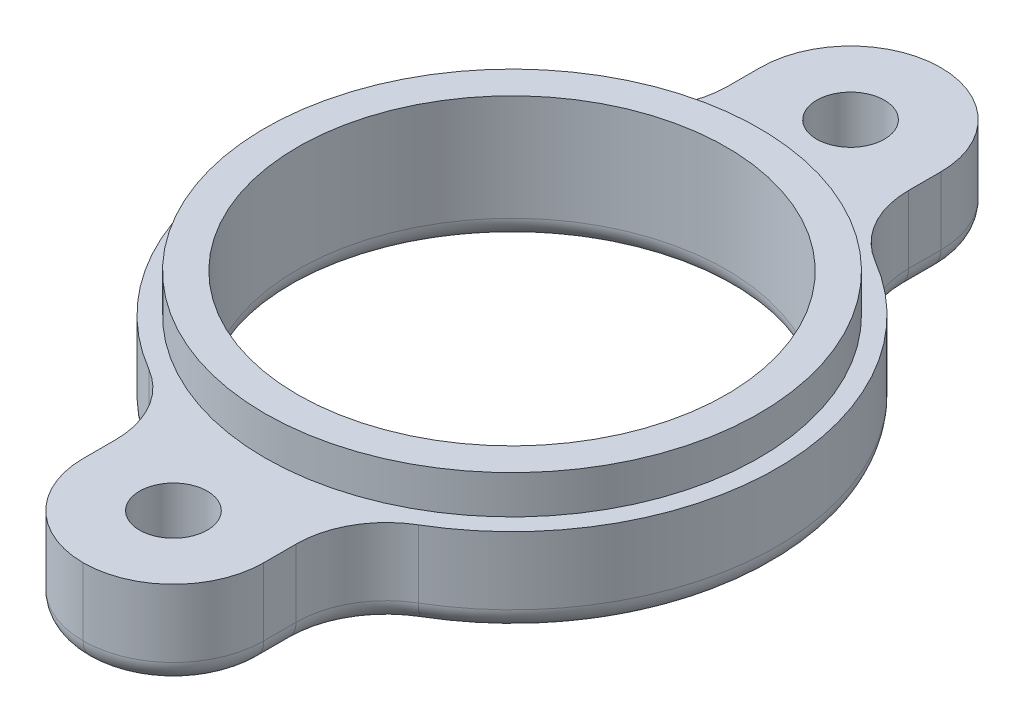
ISO-10303-21;
HEADER;
FILE_DESCRIPTION(('STEP AP214'),'2;1');
FILE_NAME('part.step','',(''),(''),'','','');
FILE_SCHEMA(('AUTOMOTIVE_DESIGN { 1 0 10303 214 1 1 1 1 }'));
ENDSEC;
DATA;
#1=APPLICATION_CONTEXT('core data for automotive mechanical design processes');
#2=APPLICATION_PROTOCOL_DEFINITION('international standard','automotive_design',2000,#1);
#3=PRODUCT_CONTEXT('',#1,'mechanical');
#4=PRODUCT('Part','Part','',(#3));
#5=PRODUCT_RELATED_PRODUCT_CATEGORY('part','',(#4));
#6=PRODUCT_DEFINITION_FORMATION('','',#4);
#7=PRODUCT_DEFINITION_CONTEXT('part definition',#1,'design');
#8=PRODUCT_DEFINITION('design','',#6,#7);
#9=PRODUCT_DEFINITION_SHAPE('','',#8);
#10=(LENGTH_UNIT() NAMED_UNIT(*) SI_UNIT(.MILLI.,.METRE.));
#11=(NAMED_UNIT(*) PLANE_ANGLE_UNIT() SI_UNIT($,.RADIAN.));
#12=(NAMED_UNIT(*) SI_UNIT($,.STERADIAN.) SOLID_ANGLE_UNIT());
#13=UNCERTAINTY_MEASURE_WITH_UNIT(LENGTH_MEASURE(1.E-05),#10,'distance_accuracy_value','');
#14=(GEOMETRIC_REPRESENTATION_CONTEXT(3) GLOBAL_UNCERTAINTY_ASSIGNED_CONTEXT((#13)) GLOBAL_UNIT_ASSIGNED_CONTEXT((#10,
#11,#12)) REPRESENTATION_CONTEXT('',''));
#15=CARTESIAN_POINT('',(0.,0.,0.));
#16=DIRECTION('',(0.,0.,1.));
#17=DIRECTION('',(1.,0.,0.));
#18=AXIS2_PLACEMENT_3D('',#15,#16,#17);
#19=CARTESIAN_POINT('',(0.,1.7,0.));
#20=DIRECTION('',(0.,1.,0.));
#21=DIRECTION('',(0.,0.,1.));
#22=AXIS2_PLACEMENT_3D('',#19,#20,#21);
#23=PLANE('',#22);
#24=CARTESIAN_POINT('',(0.,1.7,0.));
#25=DIRECTION('',(0.,1.,0.));
#26=DIRECTION('',(0.,0.,1.));
#27=AXIS2_PLACEMENT_3D('',#24,#25,#26);
#28=CIRCLE('',#27,10.95);
#29=CARTESIAN_POINT('',(0.,1.7,10.95));
#30=VERTEX_POINT('',#29);
#31=EDGE_CURVE('E207',#30,#30,#28,.T.);
#32=ORIENTED_EDGE('',*,*,#31,.T.);
#33=EDGE_LOOP('',(#32));
#34=FACE_BOUND('',#33,.T.);
#35=CARTESIAN_POINT('',(0.,1.7,0.));
#36=DIRECTION('',(0.,1.,0.));
#37=DIRECTION('',(0.,0.,1.));
#38=AXIS2_PLACEMENT_3D('',#35,#36,#37);
#39=CIRCLE('',#38,9.5);
#40=CARTESIAN_POINT('',(0.,1.7,9.5));
#41=VERTEX_POINT('',#40);
#42=EDGE_CURVE('E212',#41,#41,#39,.T.);
#43=ORIENTED_EDGE('',*,*,#42,.F.);
#44=EDGE_LOOP('',(#43));
#45=FACE_BOUND('',#44,.T.);
#46=ADVANCED_FACE('F37',(#34,#45),#23,.T.);
#47=CARTESIAN_POINT('',(0.,1.7,0.));
#48=DIRECTION('',(0.,-1.,0.));
#49=DIRECTION('',(0.,0.,-1.));
#50=AXIS2_PLACEMENT_3D('',#47,#48,#49);
#51=CYLINDRICAL_SURFACE('',#50,10.95);
#52=ORIENTED_EDGE('',*,*,#31,.F.);
#53=EDGE_LOOP('',(#52));
#54=FACE_BOUND('',#53,.T.);
#55=CARTESIAN_POINT('',(0.,0.,0.));
#56=DIRECTION('',(0.,1.,0.));
#57=DIRECTION('',(0.,0.,1.));
#58=AXIS2_PLACEMENT_3D('',#55,#56,#57);
#59=CIRCLE('',#58,10.95);
#60=CARTESIAN_POINT('',(0.,0.,10.95));
#61=VERTEX_POINT('',#60);
#62=EDGE_CURVE('E215',#61,#61,#59,.T.);
#63=ORIENTED_EDGE('',*,*,#62,.T.);
#64=EDGE_LOOP('',(#63));
#65=FACE_BOUND('',#64,.T.);
#66=ADVANCED_FACE('F438',(#54,#65),#51,.T.);
#67=CARTESIAN_POINT('',(0.,1.7,0.));
#68=DIRECTION('',(0.,-1.,0.));
#69=DIRECTION('',(0.,0.,-1.));
#70=AXIS2_PLACEMENT_3D('',#67,#68,#69);
#71=CYLINDRICAL_SURFACE('',#70,9.5);
#72=CARTESIAN_POINT('',(0.,-3.,0.));
#73=DIRECTION('',(0.,1.,0.));
#74=DIRECTION('',(0.,0.,1.));
#75=AXIS2_PLACEMENT_3D('',#72,#73,#74);
#76=CIRCLE('',#75,9.5);
#77=CARTESIAN_POINT('',(0.,-3.,9.5));
#78=VERTEX_POINT('',#77);
#79=EDGE_CURVE('E46',#78,#78,#76,.F.);
#80=ORIENTED_EDGE('',*,*,#79,.T.);
#81=EDGE_LOOP('',(#80));
#82=FACE_BOUND('',#81,.T.);
#83=ORIENTED_EDGE('',*,*,#42,.T.);
#84=EDGE_LOOP('',(#83));
#85=FACE_BOUND('',#84,.T.);
#86=ADVANCED_FACE('F444',(#82,#85),#71,.F.);
#87=CARTESIAN_POINT('',(0.,-4.,0.));
#88=DIRECTION('',(0.,1.,0.));
#89=DIRECTION('',(0.,0.,1.));
#90=AXIS2_PLACEMENT_3D('',#87,#88,#89);
#91=CYLINDRICAL_SURFACE('',#90,11.75);
#92=DIRECTION('',(0.,1.,0.));
#93=VECTOR('',#92,1.);
#94=CARTESIAN_POINT('',(5.96825396825397,-4.,10.1213855064621));
#95=LINE('',#94,#93);
#96=CARTESIAN_POINT('',(5.96825396825397,0.,10.1213855064621));
#97=VERTEX_POINT('',#96);
#98=CARTESIAN_POINT('',(5.96825396825397,-3.,10.1213855064621));
#99=VERTEX_POINT('',#98);
#100=EDGE_CURVE('E197',#97,#99,#95,.F.);
#101=ORIENTED_EDGE('',*,*,#100,.T.);
#102=CARTESIAN_POINT('',(0.,-3.,0.));
#103=DIRECTION('',(0.,1.,0.));
#104=DIRECTION('',(0.,0.,1.));
#105=AXIS2_PLACEMENT_3D('',#102,#103,#104);
#106=CIRCLE('',#105,11.75);
#107=CARTESIAN_POINT('',(5.96825396825397,-3.,-10.1213855064621));
#108=VERTEX_POINT('',#107);
#109=EDGE_CURVE('E11',#99,#108,#106,.T.);
#110=ORIENTED_EDGE('',*,*,#109,.T.);
#111=DIRECTION('',(0.,1.,0.));
#112=VECTOR('',#111,1.);
#113=CARTESIAN_POINT('',(5.96825396825397,-4.,-10.1213855064621));
#114=LINE('',#113,#112);
#115=CARTESIAN_POINT('',(5.96825396825397,0.,-10.1213855064621));
#116=VERTEX_POINT('',#115);
#117=EDGE_CURVE('E198',#108,#116,#114,.T.);
#118=ORIENTED_EDGE('',*,*,#117,.T.);
#119=CARTESIAN_POINT('',(0.,0.,0.));
#120=DIRECTION('',(0.,1.,0.));
#121=DIRECTION('',(0.,0.,1.));
#122=AXIS2_PLACEMENT_3D('',#119,#120,#121);
#123=CIRCLE('',#122,11.75);
#124=EDGE_CURVE('E187',#97,#116,#123,.T.);
#125=ORIENTED_EDGE('',*,*,#124,.F.);
#126=EDGE_LOOP('',(#101,#110,#118,#125));
#127=FACE_BOUND('',#126,.T.);
#128=ADVANCED_FACE('F196',(#127),#91,.T.);
#129=CARTESIAN_POINT('',(4.,-4.,0.));
#130=DIRECTION('',(1.,0.,0.));
#131=DIRECTION('',(0.,0.,-1.));
#132=AXIS2_PLACEMENT_3D('',#129,#130,#131);
#133=PLANE('',#132);
#134=DIRECTION('',(0.,1.,0.));
#135=VECTOR('',#134,1.);
#136=CARTESIAN_POINT('',(4.,-4.,15.));
#137=LINE('',#136,#135);
#138=CARTESIAN_POINT('',(4.,0.,15.));
#139=VERTEX_POINT('',#138);
#140=CARTESIAN_POINT('',(4.,-3.,15.));
#141=VERTEX_POINT('',#140);
#142=EDGE_CURVE('E243',#139,#141,#137,.F.);
#143=ORIENTED_EDGE('',*,*,#142,.T.);
#144=DIRECTION('',(0.,0.,-1.));
#145=VECTOR('',#144,1.);
#146=CARTESIAN_POINT('',(4.,-3.,13.5669635512151));
#147=LINE('',#146,#145);
#148=CARTESIAN_POINT('',(4.,-3.,13.5669635512151));
#149=VERTEX_POINT('',#148);
#150=EDGE_CURVE('E290',#141,#149,#147,.T.);
#151=ORIENTED_EDGE('',*,*,#150,.T.);
#152=DIRECTION('',(0.,-1.,0.));
#153=VECTOR('',#152,1.);
#154=CARTESIAN_POINT('',(4.,0.,13.5669635512151));
#155=LINE('',#154,#153);
#156=CARTESIAN_POINT('',(4.,0.,13.5669635512151));
#157=VERTEX_POINT('',#156);
#158=EDGE_CURVE('E246',#149,#157,#155,.F.);
#159=ORIENTED_EDGE('',*,*,#158,.T.);
#160=DIRECTION('',(0.,0.,-1.));
#161=VECTOR('',#160,1.);
#162=CARTESIAN_POINT('',(4.,0.,0.));
#163=LINE('',#162,#161);
#164=EDGE_CURVE('E189',#139,#157,#163,.T.);
#165=ORIENTED_EDGE('',*,*,#164,.F.);
#166=EDGE_LOOP('',(#143,#151,#159,#165));
#167=FACE_BOUND('',#166,.T.);
#168=ADVANCED_FACE('F700',(#167),#133,.T.);
#169=CARTESIAN_POINT('',(-4.,-4.,0.));
#170=DIRECTION('',(1.,0.,0.));
#171=DIRECTION('',(0.,0.,-1.));
#172=AXIS2_PLACEMENT_3D('',#169,#170,#171);
#173=PLANE('',#172);
#174=DIRECTION('',(0.,1.,0.));
#175=VECTOR('',#174,1.);
#176=CARTESIAN_POINT('',(-4.,-4.,13.5669635512151));
#177=LINE('',#176,#175);
#178=CARTESIAN_POINT('',(-4.,0.,13.5669635512151));
#179=VERTEX_POINT('',#178);
#180=CARTESIAN_POINT('',(-4.,-3.,13.5669635512151));
#181=VERTEX_POINT('',#180);
#182=EDGE_CURVE('E240',#179,#181,#177,.F.);
#183=ORIENTED_EDGE('',*,*,#182,.T.);
#184=DIRECTION('',(0.,0.,-1.));
#185=VECTOR('',#184,1.);
#186=CARTESIAN_POINT('',(-4.,-3.,0.));
#187=LINE('',#186,#185);
#188=CARTESIAN_POINT('',(-4.,-3.,15.));
#189=VERTEX_POINT('',#188);
#190=EDGE_CURVE('E296',#181,#189,#187,.F.);
#191=ORIENTED_EDGE('',*,*,#190,.T.);
#192=DIRECTION('',(0.,1.,0.));
#193=VECTOR('',#192,1.);
#194=CARTESIAN_POINT('',(-4.,0.,15.));
#195=LINE('',#194,#193);
#196=CARTESIAN_POINT('',(-4.,0.,15.));
#197=VERTEX_POINT('',#196);
#198=EDGE_CURVE('E238',#189,#197,#195,.T.);
#199=ORIENTED_EDGE('',*,*,#198,.T.);
#200=DIRECTION('',(0.,0.,-1.));
#201=VECTOR('',#200,1.);
#202=CARTESIAN_POINT('',(-4.,0.,0.));
#203=LINE('',#202,#201);
#204=EDGE_CURVE('E377',#197,#179,#203,.T.);
#205=ORIENTED_EDGE('',*,*,#204,.T.);
#206=EDGE_LOOP('',(#183,#191,#199,#205));
#207=FACE_BOUND('',#206,.T.);
#208=ADVANCED_FACE('F434',(#207),#173,.F.);
#209=CARTESIAN_POINT('',(0.,-4.,0.));
#210=DIRECTION('',(0.,1.,0.));
#211=DIRECTION('',(0.,0.,1.));
#212=AXIS2_PLACEMENT_3D('',#209,#210,#211);
#213=CYLINDRICAL_SURFACE('',#212,11.75);
#214=DIRECTION('',(0.,1.,0.));
#215=VECTOR('',#214,1.);
#216=CARTESIAN_POINT('',(-5.96825396825397,-4.,-10.1213855064621));
#217=LINE('',#216,#215);
#218=CARTESIAN_POINT('',(-5.96825396825397,0.,-10.1213855064621));
#219=VERTEX_POINT('',#218);
#220=CARTESIAN_POINT('',(-5.96825396825397,-3.,-10.1213855064621));
#221=VERTEX_POINT('',#220);
#222=EDGE_CURVE('E235',#219,#221,#217,.F.);
#223=ORIENTED_EDGE('',*,*,#222,.T.);
#224=CARTESIAN_POINT('',(0.,-3.,0.));
#225=DIRECTION('',(0.,1.,0.));
#226=DIRECTION('',(0.,0.,1.));
#227=AXIS2_PLACEMENT_3D('',#224,#225,#226);
#228=CIRCLE('',#227,11.75);
#229=CARTESIAN_POINT('',(-5.96825396825397,-3.,10.1213855064621));
#230=VERTEX_POINT('',#229);
#231=EDGE_CURVE('E300',#221,#230,#228,.T.);
#232=ORIENTED_EDGE('',*,*,#231,.T.);
#233=DIRECTION('',(0.,1.,0.));
#234=VECTOR('',#233,1.);
#235=CARTESIAN_POINT('',(-5.96825396825397,-4.,10.1213855064621));
#236=LINE('',#235,#234);
#237=CARTESIAN_POINT('',(-5.96825396825397,0.,10.1213855064621));
#238=VERTEX_POINT('',#237);
#239=EDGE_CURVE('E233',#230,#238,#236,.T.);
#240=ORIENTED_EDGE('',*,*,#239,.T.);
#241=CARTESIAN_POINT('',(0.,0.,0.));
#242=DIRECTION('',(0.,1.,0.));
#243=DIRECTION('',(0.,0.,1.));
#244=AXIS2_PLACEMENT_3D('',#241,#242,#243);
#245=CIRCLE('',#244,11.75);
#246=EDGE_CURVE('E375',#219,#238,#245,.T.);
#247=ORIENTED_EDGE('',*,*,#246,.F.);
#248=EDGE_LOOP('',(#223,#232,#240,#247));
#249=FACE_BOUND('',#248,.T.);
#250=ADVANCED_FACE('F372',(#249),#213,.T.);
#251=CARTESIAN_POINT('',(-4.,-4.,0.));
#252=DIRECTION('',(1.,0.,0.));
#253=DIRECTION('',(0.,0.,-1.));
#254=AXIS2_PLACEMENT_3D('',#251,#252,#253);
#255=PLANE('',#254);
#256=DIRECTION('',(0.,1.,0.));
#257=VECTOR('',#256,1.);
#258=CARTESIAN_POINT('',(-4.,-4.,-15.));
#259=LINE('',#258,#257);
#260=CARTESIAN_POINT('',(-4.,0.,-15.));
#261=VERTEX_POINT('',#260);
#262=CARTESIAN_POINT('',(-4.,-3.,-15.));
#263=VERTEX_POINT('',#262);
#264=EDGE_CURVE('E230',#261,#263,#259,.F.);
#265=ORIENTED_EDGE('',*,*,#264,.T.);
#266=DIRECTION('',(0.,0.,-1.));
#267=VECTOR('',#266,1.);
#268=CARTESIAN_POINT('',(-4.,-3.,0.));
#269=LINE('',#268,#267);
#270=CARTESIAN_POINT('',(-4.,-3.,-13.5669635512151));
#271=VERTEX_POINT('',#270);
#272=EDGE_CURVE('E304',#263,#271,#269,.F.);
#273=ORIENTED_EDGE('',*,*,#272,.T.);
#274=DIRECTION('',(0.,1.,0.));
#275=VECTOR('',#274,1.);
#276=CARTESIAN_POINT('',(-4.,-4.,-13.5669635512151));
#277=LINE('',#276,#275);
#278=CARTESIAN_POINT('',(-4.,0.,-13.5669635512151));
#279=VERTEX_POINT('',#278);
#280=EDGE_CURVE('E228',#271,#279,#277,.T.);
#281=ORIENTED_EDGE('',*,*,#280,.T.);
#282=DIRECTION('',(0.,0.,-1.));
#283=VECTOR('',#282,1.);
#284=CARTESIAN_POINT('',(-4.,0.,0.));
#285=LINE('',#284,#283);
#286=EDGE_CURVE('E378',#279,#261,#285,.T.);
#287=ORIENTED_EDGE('',*,*,#286,.T.);
#288=EDGE_LOOP('',(#265,#273,#281,#287));
#289=FACE_BOUND('',#288,.T.);
#290=ADVANCED_FACE('F423',(#289),#255,.F.);
#291=CARTESIAN_POINT('',(0.,-4.,15.));
#292=DIRECTION('',(0.,1.,0.));
#293=DIRECTION('',(0.,0.,1.));
#294=AXIS2_PLACEMENT_3D('',#291,#292,#293);
#295=CYLINDRICAL_SURFACE('',#294,1.5);
#296=CARTESIAN_POINT('',(0.,-4.,15.));
#297=DIRECTION('',(0.,1.,0.));
#298=DIRECTION('',(0.,0.,1.));
#299=AXIS2_PLACEMENT_3D('',#296,#297,#298);
#300=CIRCLE('',#299,1.5);
#301=CARTESIAN_POINT('',(0.,-4.,16.5));
#302=VERTEX_POINT('',#301);
#303=EDGE_CURVE('E393',#302,#302,#300,.T.);
#304=ORIENTED_EDGE('',*,*,#303,.F.);
#305=EDGE_LOOP('',(#304));
#306=FACE_BOUND('',#305,.T.);
#307=CARTESIAN_POINT('',(0.,0.,15.));
#308=DIRECTION('',(0.,1.,0.));
#309=DIRECTION('',(0.,0.,1.));
#310=AXIS2_PLACEMENT_3D('',#307,#308,#309);
#311=CIRCLE('',#310,1.5);
#312=CARTESIAN_POINT('',(0.,0.,16.5));
#313=VERTEX_POINT('',#312);
#314=EDGE_CURVE('E387',#313,#313,#311,.T.);
#315=ORIENTED_EDGE('',*,*,#314,.T.);
#316=EDGE_LOOP('',(#315));
#317=FACE_BOUND('',#316,.T.);
#318=ADVANCED_FACE('F425',(#306,#317),#295,.F.);
#319=CARTESIAN_POINT('',(4.,-4.,0.));
#320=DIRECTION('',(1.,0.,0.));
#321=DIRECTION('',(0.,0.,-1.));
#322=AXIS2_PLACEMENT_3D('',#319,#320,#321);
#323=PLANE('',#322);
#324=DIRECTION('',(0.,-1.,0.));
#325=VECTOR('',#324,1.);
#326=CARTESIAN_POINT('',(4.,-4.,-13.5669635512151));
#327=LINE('',#326,#325);
#328=CARTESIAN_POINT('',(4.,0.,-13.5669635512151));
#329=VERTEX_POINT('',#328);
#330=CARTESIAN_POINT('',(4.,-3.,-13.5669635512151));
#331=VERTEX_POINT('',#330);
#332=EDGE_CURVE('E218',#329,#331,#327,.T.);
#333=ORIENTED_EDGE('',*,*,#332,.T.);
#334=DIRECTION('',(0.,0.,-1.));
#335=VECTOR('',#334,1.);
#336=CARTESIAN_POINT('',(4.,-3.,-15.));
#337=LINE('',#336,#335);
#338=CARTESIAN_POINT('',(4.,-3.,-15.));
#339=VERTEX_POINT('',#338);
#340=EDGE_CURVE('E310',#331,#339,#337,.T.);
#341=ORIENTED_EDGE('',*,*,#340,.T.);
#342=DIRECTION('',(0.,1.,0.));
#343=VECTOR('',#342,1.);
#344=CARTESIAN_POINT('',(4.,0.,-15.));
#345=LINE('',#344,#343);
#346=CARTESIAN_POINT('',(4.,0.,-15.));
#347=VERTEX_POINT('',#346);
#348=EDGE_CURVE('E209',#339,#347,#345,.T.);
#349=ORIENTED_EDGE('',*,*,#348,.T.);
#350=DIRECTION('',(0.,0.,-1.));
#351=VECTOR('',#350,1.);
#352=CARTESIAN_POINT('',(4.,0.,0.));
#353=LINE('',#352,#351);
#354=EDGE_CURVE('E200',#329,#347,#353,.T.);
#355=ORIENTED_EDGE('',*,*,#354,.F.);
#356=EDGE_LOOP('',(#333,#341,#349,#355));
#357=FACE_BOUND('',#356,.T.);
#358=ADVANCED_FACE('F431',(#357),#323,.T.);
#359=CARTESIAN_POINT('',(0.,-4.,-15.));
#360=DIRECTION('',(0.,1.,0.));
#361=DIRECTION('',(0.,0.,1.));
#362=AXIS2_PLACEMENT_3D('',#359,#360,#361);
#363=CYLINDRICAL_SURFACE('',#362,1.5);
#364=CARTESIAN_POINT('',(0.,-4.,-15.));
#365=DIRECTION('',(0.,1.,0.));
#366=DIRECTION('',(0.,0.,1.));
#367=AXIS2_PLACEMENT_3D('',#364,#365,#366);
#368=CIRCLE('',#367,1.5);
#369=CARTESIAN_POINT('',(0.,-4.,-13.5));
#370=VERTEX_POINT('',#369);
#371=EDGE_CURVE('E398',#370,#370,#368,.T.);
#372=ORIENTED_EDGE('',*,*,#371,.F.);
#373=EDGE_LOOP('',(#372));
#374=FACE_BOUND('',#373,.T.);
#375=CARTESIAN_POINT('',(0.,0.,-15.));
#376=DIRECTION('',(0.,1.,0.));
#377=DIRECTION('',(0.,0.,1.));
#378=AXIS2_PLACEMENT_3D('',#375,#376,#377);
#379=CIRCLE('',#378,1.5);
#380=CARTESIAN_POINT('',(0.,0.,-13.5));
#381=VERTEX_POINT('',#380);
#382=EDGE_CURVE('E390',#381,#381,#379,.T.);
#383=ORIENTED_EDGE('',*,*,#382,.T.);
#384=EDGE_LOOP('',(#383));
#385=FACE_BOUND('',#384,.T.);
#386=ADVANCED_FACE('F682',(#374,#385),#363,.F.);
#387=CARTESIAN_POINT('',(0.,-4.,0.));
#388=DIRECTION('',(0.,1.,0.));
#389=DIRECTION('',(0.,0.,1.));
#390=AXIS2_PLACEMENT_3D('',#387,#388,#389);
#391=PLANE('',#390);
#392=CARTESIAN_POINT('',(0.,-4.,0.));
#393=DIRECTION('',(0.,1.,0.));
#394=DIRECTION('',(0.,0.,1.));
#395=AXIS2_PLACEMENT_3D('',#392,#393,#394);
#396=CIRCLE('',#395,10.5);
#397=CARTESIAN_POINT('',(0.,-4.,10.5));
#398=VERTEX_POINT('',#397);
#399=EDGE_CURVE('E286',#398,#398,#396,.T.);
#400=ORIENTED_EDGE('',*,*,#399,.T.);
#401=EDGE_LOOP('',(#400));
#402=FACE_BOUND('',#401,.T.);
#403=CARTESIAN_POINT('',(0.,-4.,0.));
#404=DIRECTION('',(0.,1.,0.));
#405=DIRECTION('',(0.,0.,1.));
#406=AXIS2_PLACEMENT_3D('',#403,#404,#405);
#407=CIRCLE('',#406,10.75);
#408=CARTESIAN_POINT('',(5.46031746031746,-4.,-9.25999099527382));
#409=VERTEX_POINT('',#408);
#410=CARTESIAN_POINT('',(5.46031746031746,-4.,9.25999099527382));
#411=VERTEX_POINT('',#410);
#412=EDGE_CURVE('E193',#409,#411,#407,.F.);
#413=ORIENTED_EDGE('',*,*,#412,.T.);
#414=CARTESIAN_POINT('',(8.,-4.,13.5669635512151));
#415=DIRECTION('',(0.,1.,0.));
#416=DIRECTION('',(0.,0.,1.));
#417=AXIS2_PLACEMENT_3D('',#414,#415,#416);
#418=CIRCLE('',#417,5.);
#419=CARTESIAN_POINT('',(3.,-4.,13.5669635512151));
#420=VERTEX_POINT('',#419);
#421=EDGE_CURVE('E283',#411,#420,#418,.T.);
#422=ORIENTED_EDGE('',*,*,#421,.T.);
#423=DIRECTION('',(0.,0.,-1.));
#424=VECTOR('',#423,1.);
#425=CARTESIAN_POINT('',(3.,-4.,15.));
#426=LINE('',#425,#424);
#427=CARTESIAN_POINT('',(3.,-4.,15.));
#428=VERTEX_POINT('',#427);
#429=EDGE_CURVE('E281',#420,#428,#426,.F.);
#430=ORIENTED_EDGE('',*,*,#429,.T.);
#431=CARTESIAN_POINT('',(0.,-4.,15.));
#432=DIRECTION('',(0.,1.,0.));
#433=DIRECTION('',(0.,0.,1.));
#434=AXIS2_PLACEMENT_3D('',#431,#432,#433);
#435=CIRCLE('',#434,3.);
#436=CARTESIAN_POINT('',(0.,-4.,18.));
#437=VERTEX_POINT('',#436);
#438=EDGE_CURVE('E279',#428,#437,#435,.F.);
#439=ORIENTED_EDGE('',*,*,#438,.T.);
#440=CARTESIAN_POINT('',(0.,-4.,15.));
#441=DIRECTION('',(0.,1.,0.));
#442=DIRECTION('',(0.,0.,1.));
#443=AXIS2_PLACEMENT_3D('',#440,#441,#442);
#444=CIRCLE('',#443,3.);
#445=CARTESIAN_POINT('',(-3.,-4.,15.));
#446=VERTEX_POINT('',#445);
#447=EDGE_CURVE('E277',#437,#446,#444,.F.);
#448=ORIENTED_EDGE('',*,*,#447,.T.);
#449=DIRECTION('',(0.,0.,-1.));
#450=VECTOR('',#449,1.);
#451=CARTESIAN_POINT('',(-3.,-4.,0.));
#452=LINE('',#451,#450);
#453=CARTESIAN_POINT('',(-3.,-4.,13.5669635512151));
#454=VERTEX_POINT('',#453);
#455=EDGE_CURVE('E275',#446,#454,#452,.T.);
#456=ORIENTED_EDGE('',*,*,#455,.T.);
#457=CARTESIAN_POINT('',(-8.,-4.,13.5669635512151));
#458=DIRECTION('',(0.,1.,0.));
#459=DIRECTION('',(0.,0.,1.));
#460=AXIS2_PLACEMENT_3D('',#457,#458,#459);
#461=CIRCLE('',#460,5.);
#462=CARTESIAN_POINT('',(-5.46031746031746,-4.,9.25999099527382));
#463=VERTEX_POINT('',#462);
#464=EDGE_CURVE('E273',#454,#463,#461,.T.);
#465=ORIENTED_EDGE('',*,*,#464,.T.);
#466=CARTESIAN_POINT('',(0.,-4.,0.));
#467=DIRECTION('',(0.,1.,0.));
#468=DIRECTION('',(0.,0.,1.));
#469=AXIS2_PLACEMENT_3D('',#466,#467,#468);
#470=CIRCLE('',#469,10.75);
#471=CARTESIAN_POINT('',(-5.46031746031746,-4.,-9.25999099527382));
#472=VERTEX_POINT('',#471);
#473=EDGE_CURVE('E271',#463,#472,#470,.F.);
#474=ORIENTED_EDGE('',*,*,#473,.T.);
#475=CARTESIAN_POINT('',(-8.,-4.,-13.5669635512151));
#476=DIRECTION('',(0.,1.,0.));
#477=DIRECTION('',(0.,0.,1.));
#478=AXIS2_PLACEMENT_3D('',#475,#476,#477);
#479=CIRCLE('',#478,5.);
#480=CARTESIAN_POINT('',(-3.,-4.,-13.5669635512151));
#481=VERTEX_POINT('',#480);
#482=EDGE_CURVE('E269',#472,#481,#479,.T.);
#483=ORIENTED_EDGE('',*,*,#482,.T.);
#484=DIRECTION('',(0.,0.,-1.));
#485=VECTOR('',#484,1.);
#486=CARTESIAN_POINT('',(-3.,-4.,0.));
#487=LINE('',#486,#485);
#488=CARTESIAN_POINT('',(-3.,-4.,-15.));
#489=VERTEX_POINT('',#488);
#490=EDGE_CURVE('E267',#481,#489,#487,.T.);
#491=ORIENTED_EDGE('',*,*,#490,.T.);
#492=CARTESIAN_POINT('',(0.,-4.,-15.));
#493=DIRECTION('',(0.,1.,0.));
#494=DIRECTION('',(0.,0.,1.));
#495=AXIS2_PLACEMENT_3D('',#492,#493,#494);
#496=CIRCLE('',#495,3.);
#497=CARTESIAN_POINT('',(0.,-4.,-18.));
#498=VERTEX_POINT('',#497);
#499=EDGE_CURVE('E265',#489,#498,#496,.F.);
#500=ORIENTED_EDGE('',*,*,#499,.T.);
#501=CARTESIAN_POINT('',(0.,-4.,-15.));
#502=DIRECTION('',(0.,1.,0.));
#503=DIRECTION('',(0.,0.,1.));
#504=AXIS2_PLACEMENT_3D('',#501,#502,#503);
#505=CIRCLE('',#504,3.);
#506=CARTESIAN_POINT('',(3.,-4.,-15.));
#507=VERTEX_POINT('',#506);
#508=EDGE_CURVE('E263',#498,#507,#505,.F.);
#509=ORIENTED_EDGE('',*,*,#508,.T.);
#510=DIRECTION('',(0.,0.,-1.));
#511=VECTOR('',#510,1.);
#512=CARTESIAN_POINT('',(3.,-4.,-13.5669635512151));
#513=LINE('',#512,#511);
#514=CARTESIAN_POINT('',(3.,-4.,-13.5669635512151));
#515=VERTEX_POINT('',#514);
#516=EDGE_CURVE('E261',#507,#515,#513,.F.);
#517=ORIENTED_EDGE('',*,*,#516,.T.);
#518=CARTESIAN_POINT('',(8.,-4.,-13.5669635512151));
#519=DIRECTION('',(0.,1.,0.));
#520=DIRECTION('',(0.,0.,1.));
#521=AXIS2_PLACEMENT_3D('',#518,#519,#520);
#522=CIRCLE('',#521,5.);
#523=EDGE_CURVE('E259',#515,#409,#522,.T.);
#524=ORIENTED_EDGE('',*,*,#523,.T.);
#525=EDGE_LOOP('',(#413,#422,#430,#439,#448,#456,#465,#474,#483,#491,#500,#509,#517,#524));
#526=FACE_BOUND('',#525,.T.);
#527=ORIENTED_EDGE('',*,*,#303,.T.);
#528=EDGE_LOOP('',(#527));
#529=FACE_BOUND('',#528,.T.);
#530=ORIENTED_EDGE('',*,*,#371,.T.);
#531=EDGE_LOOP('',(#530));
#532=FACE_BOUND('',#531,.T.);
#533=ADVANCED_FACE('F671',(#402,#526,#529,#532),#391,.F.);
#534=CARTESIAN_POINT('',(0.,0.,0.));
#535=DIRECTION('',(0.,1.,0.));
#536=DIRECTION('',(0.,0.,1.));
#537=AXIS2_PLACEMENT_3D('',#534,#535,#536);
#538=PLANE('',#537);
#539=ORIENTED_EDGE('',*,*,#62,.F.);
#540=EDGE_LOOP('',(#539));
#541=FACE_BOUND('',#540,.T.);
#542=CARTESIAN_POINT('',(0.,0.,15.));
#543=DIRECTION('',(0.,1.,0.));
#544=DIRECTION('',(0.,0.,1.));
#545=AXIS2_PLACEMENT_3D('',#542,#543,#544);
#546=CIRCLE('',#545,4.);
#547=CARTESIAN_POINT('',(0.,0.,19.));
#548=VERTEX_POINT('',#547);
#549=EDGE_CURVE('E224',#197,#548,#546,.T.);
#550=ORIENTED_EDGE('',*,*,#549,.T.);
#551=CARTESIAN_POINT('',(0.,0.,15.));
#552=DIRECTION('',(0.,1.,0.));
#553=DIRECTION('',(0.,0.,1.));
#554=AXIS2_PLACEMENT_3D('',#551,#552,#553);
#555=CIRCLE('',#554,4.);
#556=EDGE_CURVE('E226',#548,#139,#555,.T.);
#557=ORIENTED_EDGE('',*,*,#556,.T.);
#558=ORIENTED_EDGE('',*,*,#164,.T.);
#559=CARTESIAN_POINT('',(8.,0.,13.5669635512151));
#560=DIRECTION('',(0.,1.,0.));
#561=DIRECTION('',(0.,0.,1.));
#562=AXIS2_PLACEMENT_3D('',#559,#560,#561);
#563=CIRCLE('',#562,4.);
#564=EDGE_CURVE('E183',#157,#97,#563,.F.);
#565=ORIENTED_EDGE('',*,*,#564,.T.);
#566=ORIENTED_EDGE('',*,*,#124,.T.);
#567=CARTESIAN_POINT('',(8.,0.,-13.5669635512151));
#568=DIRECTION('',(0.,1.,0.));
#569=DIRECTION('',(0.,0.,1.));
#570=AXIS2_PLACEMENT_3D('',#567,#568,#569);
#571=CIRCLE('',#570,4.);
#572=EDGE_CURVE('E248',#116,#329,#571,.F.);
#573=ORIENTED_EDGE('',*,*,#572,.T.);
#574=ORIENTED_EDGE('',*,*,#354,.T.);
#575=CARTESIAN_POINT('',(0.,0.,-15.));
#576=DIRECTION('',(0.,1.,0.));
#577=DIRECTION('',(0.,0.,1.));
#578=AXIS2_PLACEMENT_3D('',#575,#576,#577);
#579=CIRCLE('',#578,4.);
#580=CARTESIAN_POINT('',(0.,0.,-19.));
#581=VERTEX_POINT('',#580);
#582=EDGE_CURVE('E220',#347,#581,#579,.T.);
#583=ORIENTED_EDGE('',*,*,#582,.T.);
#584=CARTESIAN_POINT('',(0.,0.,-15.));
#585=DIRECTION('',(0.,1.,0.));
#586=DIRECTION('',(0.,0.,1.));
#587=AXIS2_PLACEMENT_3D('',#584,#585,#586);
#588=CIRCLE('',#587,4.);
#589=EDGE_CURVE('E222',#581,#261,#588,.T.);
#590=ORIENTED_EDGE('',*,*,#589,.T.);
#591=ORIENTED_EDGE('',*,*,#286,.F.);
#592=CARTESIAN_POINT('',(-8.,0.,-13.5669635512151));
#593=DIRECTION('',(0.,1.,0.));
#594=DIRECTION('',(0.,0.,1.));
#595=AXIS2_PLACEMENT_3D('',#592,#593,#594);
#596=CIRCLE('',#595,4.);
#597=EDGE_CURVE('E250',#279,#219,#596,.F.);
#598=ORIENTED_EDGE('',*,*,#597,.T.);
#599=ORIENTED_EDGE('',*,*,#246,.T.);
#600=CARTESIAN_POINT('',(-8.,0.,13.5669635512151));
#601=DIRECTION('',(0.,1.,0.));
#602=DIRECTION('',(0.,0.,1.));
#603=AXIS2_PLACEMENT_3D('',#600,#601,#602);
#604=CIRCLE('',#603,4.);
#605=EDGE_CURVE('E194',#238,#179,#604,.F.);
#606=ORIENTED_EDGE('',*,*,#605,.T.);
#607=ORIENTED_EDGE('',*,*,#204,.F.);
#608=EDGE_LOOP('',(#550,#557,#558,#565,#566,#573,#574,#583,#590,#591,#598,#599,#606,#607));
#609=FACE_BOUND('',#608,.T.);
#610=ORIENTED_EDGE('',*,*,#314,.F.);
#611=EDGE_LOOP('',(#610));
#612=FACE_BOUND('',#611,.T.);
#613=ORIENTED_EDGE('',*,*,#382,.F.);
#614=EDGE_LOOP('',(#613));
#615=FACE_BOUND('',#614,.T.);
#616=ADVANCED_FACE('F185',(#541,#609,#612,#615),#538,.T.);
#617=CARTESIAN_POINT('',(8.,-4.,-13.5669635512151));
#618=DIRECTION('',(0.,1.,0.));
#619=DIRECTION('',(0.,0.,1.));
#620=AXIS2_PLACEMENT_3D('',#617,#618,#619);
#621=CYLINDRICAL_SURFACE('',#620,4.);
#622=ORIENTED_EDGE('',*,*,#117,.F.);
#623=CARTESIAN_POINT('',(8.,-3.,-13.5669635512151));
#624=DIRECTION('',(0.,1.,0.));
#625=DIRECTION('',(0.,0.,1.));
#626=AXIS2_PLACEMENT_3D('',#623,#624,#625);
#627=CIRCLE('',#626,4.);
#628=EDGE_CURVE('E59',#108,#331,#627,.F.);
#629=ORIENTED_EDGE('',*,*,#628,.T.);
#630=ORIENTED_EDGE('',*,*,#332,.F.);
#631=ORIENTED_EDGE('',*,*,#572,.F.);
#632=EDGE_LOOP('',(#622,#629,#630,#631));
#633=FACE_BOUND('',#632,.T.);
#634=ADVANCED_FACE('F451',(#633),#621,.F.);
#635=CARTESIAN_POINT('',(0.,-4.,-15.));
#636=DIRECTION('',(0.,-1.,0.));
#637=DIRECTION('',(0.,0.,-1.));
#638=AXIS2_PLACEMENT_3D('',#635,#636,#637);
#639=CYLINDRICAL_SURFACE('',#638,4.);
#640=ORIENTED_EDGE('',*,*,#348,.F.);
#641=CARTESIAN_POINT('',(0.,-3.,-15.));
#642=DIRECTION('',(0.,1.,0.));
#643=DIRECTION('',(0.,0.,1.));
#644=AXIS2_PLACEMENT_3D('',#641,#642,#643);
#645=CIRCLE('',#644,4.);
#646=CARTESIAN_POINT('',(0.,-3.,-19.));
#647=VERTEX_POINT('',#646);
#648=EDGE_CURVE('E308',#339,#647,#645,.T.);
#649=ORIENTED_EDGE('',*,*,#648,.T.);
#650=DIRECTION('',(0.,1.,0.));
#651=VECTOR('',#650,1.);
#652=CARTESIAN_POINT('',(0.,-4.,-19.));
#653=LINE('',#652,#651);
#654=EDGE_CURVE('E201',#581,#647,#653,.F.);
#655=ORIENTED_EDGE('',*,*,#654,.F.);
#656=ORIENTED_EDGE('',*,*,#582,.F.);
#657=EDGE_LOOP('',(#640,#649,#655,#656));
#658=FACE_BOUND('',#657,.T.);
#659=ADVANCED_FACE('F414',(#658),#639,.T.);
#660=CARTESIAN_POINT('',(0.,-4.,-15.));
#661=DIRECTION('',(0.,1.,0.));
#662=DIRECTION('',(0.,0.,1.));
#663=AXIS2_PLACEMENT_3D('',#660,#661,#662);
#664=CYLINDRICAL_SURFACE('',#663,4.);
#665=ORIENTED_EDGE('',*,*,#654,.T.);
#666=CARTESIAN_POINT('',(0.,-3.,-15.));
#667=DIRECTION('',(0.,1.,0.));
#668=DIRECTION('',(0.,0.,1.));
#669=AXIS2_PLACEMENT_3D('',#666,#667,#668);
#670=CIRCLE('',#669,4.);
#671=EDGE_CURVE('E306',#647,#263,#670,.T.);
#672=ORIENTED_EDGE('',*,*,#671,.T.);
#673=ORIENTED_EDGE('',*,*,#264,.F.);
#674=ORIENTED_EDGE('',*,*,#589,.F.);
#675=EDGE_LOOP('',(#665,#672,#673,#674));
#676=FACE_BOUND('',#675,.T.);
#677=ADVANCED_FACE('F420',(#676),#664,.T.);
#678=CARTESIAN_POINT('',(-8.,-4.,-13.5669635512151));
#679=DIRECTION('',(0.,1.,0.));
#680=DIRECTION('',(0.,0.,1.));
#681=AXIS2_PLACEMENT_3D('',#678,#679,#680);
#682=CYLINDRICAL_SURFACE('',#681,4.);
#683=ORIENTED_EDGE('',*,*,#280,.F.);
#684=CARTESIAN_POINT('',(-8.,-3.,-13.5669635512151));
#685=DIRECTION('',(0.,1.,0.));
#686=DIRECTION('',(0.,0.,1.));
#687=AXIS2_PLACEMENT_3D('',#684,#685,#686);
#688=CIRCLE('',#687,4.);
#689=EDGE_CURVE('E302',#271,#221,#688,.F.);
#690=ORIENTED_EDGE('',*,*,#689,.T.);
#691=ORIENTED_EDGE('',*,*,#222,.F.);
#692=ORIENTED_EDGE('',*,*,#597,.F.);
#693=EDGE_LOOP('',(#683,#690,#691,#692));
#694=FACE_BOUND('',#693,.T.);
#695=ADVANCED_FACE('F368',(#694),#682,.F.);
#696=CARTESIAN_POINT('',(-8.,-4.,13.5669635512151));
#697=DIRECTION('',(0.,1.,0.));
#698=DIRECTION('',(0.,0.,1.));
#699=AXIS2_PLACEMENT_3D('',#696,#697,#698);
#700=CYLINDRICAL_SURFACE('',#699,4.);
#701=ORIENTED_EDGE('',*,*,#239,.F.);
#702=CARTESIAN_POINT('',(-8.,-3.,13.5669635512151));
#703=DIRECTION('',(0.,1.,0.));
#704=DIRECTION('',(0.,0.,1.));
#705=AXIS2_PLACEMENT_3D('',#702,#703,#704);
#706=CIRCLE('',#705,4.);
#707=EDGE_CURVE('E298',#230,#181,#706,.F.);
#708=ORIENTED_EDGE('',*,*,#707,.T.);
#709=ORIENTED_EDGE('',*,*,#182,.F.);
#710=ORIENTED_EDGE('',*,*,#605,.F.);
#711=EDGE_LOOP('',(#701,#708,#709,#710));
#712=FACE_BOUND('',#711,.T.);
#713=ADVANCED_FACE('F460',(#712),#700,.F.);
#714=CARTESIAN_POINT('',(8.,-4.,13.5669635512151));
#715=DIRECTION('',(0.,1.,0.));
#716=DIRECTION('',(0.,0.,1.));
#717=AXIS2_PLACEMENT_3D('',#714,#715,#716);
#718=CYLINDRICAL_SURFACE('',#717,4.);
#719=ORIENTED_EDGE('',*,*,#158,.F.);
#720=CARTESIAN_POINT('',(8.,-3.,13.5669635512151));
#721=DIRECTION('',(0.,1.,0.));
#722=DIRECTION('',(0.,0.,1.));
#723=AXIS2_PLACEMENT_3D('',#720,#721,#722);
#724=CIRCLE('',#723,4.);
#725=EDGE_CURVE('E206',#149,#99,#724,.F.);
#726=ORIENTED_EDGE('',*,*,#725,.T.);
#727=ORIENTED_EDGE('',*,*,#100,.F.);
#728=ORIENTED_EDGE('',*,*,#564,.F.);
#729=EDGE_LOOP('',(#719,#726,#727,#728));
#730=FACE_BOUND('',#729,.T.);
#731=ADVANCED_FACE('F204',(#730),#718,.F.);
#732=CARTESIAN_POINT('',(0.,-4.,15.));
#733=DIRECTION('',(0.,-1.,0.));
#734=DIRECTION('',(0.,0.,-1.));
#735=AXIS2_PLACEMENT_3D('',#732,#733,#734);
#736=CYLINDRICAL_SURFACE('',#735,4.);
#737=ORIENTED_EDGE('',*,*,#198,.F.);
#738=CARTESIAN_POINT('',(0.,-3.,15.));
#739=DIRECTION('',(0.,1.,0.));
#740=DIRECTION('',(0.,0.,1.));
#741=AXIS2_PLACEMENT_3D('',#738,#739,#740);
#742=CIRCLE('',#741,4.);
#743=CARTESIAN_POINT('',(0.,-3.,19.));
#744=VERTEX_POINT('',#743);
#745=EDGE_CURVE('E294',#189,#744,#742,.T.);
#746=ORIENTED_EDGE('',*,*,#745,.T.);
#747=DIRECTION('',(0.,1.,0.));
#748=VECTOR('',#747,1.);
#749=CARTESIAN_POINT('',(0.,-4.,19.));
#750=LINE('',#749,#748);
#751=EDGE_CURVE('E255',#548,#744,#750,.F.);
#752=ORIENTED_EDGE('',*,*,#751,.F.);
#753=ORIENTED_EDGE('',*,*,#549,.F.);
#754=EDGE_LOOP('',(#737,#746,#752,#753));
#755=FACE_BOUND('',#754,.T.);
#756=ADVANCED_FACE('F466',(#755),#736,.T.);
#757=CARTESIAN_POINT('',(0.,-4.,15.));
#758=DIRECTION('',(0.,1.,0.));
#759=DIRECTION('',(0.,0.,1.));
#760=AXIS2_PLACEMENT_3D('',#757,#758,#759);
#761=CYLINDRICAL_SURFACE('',#760,4.);
#762=ORIENTED_EDGE('',*,*,#751,.T.);
#763=CARTESIAN_POINT('',(0.,-3.,15.));
#764=DIRECTION('',(0.,1.,0.));
#765=DIRECTION('',(0.,0.,1.));
#766=AXIS2_PLACEMENT_3D('',#763,#764,#765);
#767=CIRCLE('',#766,4.);
#768=EDGE_CURVE('E292',#744,#141,#767,.T.);
#769=ORIENTED_EDGE('',*,*,#768,.T.);
#770=ORIENTED_EDGE('',*,*,#142,.F.);
#771=ORIENTED_EDGE('',*,*,#556,.F.);
#772=EDGE_LOOP('',(#762,#769,#770,#771));
#773=FACE_BOUND('',#772,.T.);
#774=ADVANCED_FACE('F467',(#773),#761,.T.);
#775=CARTESIAN_POINT('',(-8.,-3.,-13.5669635512151));
#776=DIRECTION('',(0.,1.,0.));
#777=DIRECTION('',(0.,0.,1.));
#778=AXIS2_PLACEMENT_3D('',#775,#776,#777);
#779=TOROIDAL_SURFACE('',#778,5.,1.);
#780=CARTESIAN_POINT('',(-5.46031746031746,-3.,-9.25999099527382));
#781=DIRECTION('',(-0.861394511188263,0.,0.507936507936507));
#782=DIRECTION('',(0.507936507936507,0.,0.861394511188263));
#783=AXIS2_PLACEMENT_3D('',#780,#781,#782);
#784=CIRCLE('',#783,1.);
#785=EDGE_CURVE('E348',#221,#472,#784,.T.);
#786=ORIENTED_EDGE('',*,*,#785,.F.);
#787=ORIENTED_EDGE('',*,*,#689,.F.);
#788=CARTESIAN_POINT('',(-3.,-3.,-13.5669635512151));
#789=DIRECTION('',(0.,0.,-1.));
#790=DIRECTION('',(-1.,0.,0.));
#791=AXIS2_PLACEMENT_3D('',#788,#789,#790);
#792=CIRCLE('',#791,1.);
#793=EDGE_CURVE('E41',#481,#271,#792,.T.);
#794=ORIENTED_EDGE('',*,*,#793,.F.);
#795=ORIENTED_EDGE('',*,*,#482,.F.);
#796=EDGE_LOOP('',(#786,#787,#794,#795));
#797=FACE_BOUND('',#796,.T.);
#798=ADVANCED_FACE('F364',(#797),#779,.T.);
#799=CARTESIAN_POINT('',(-3.,-3.,0.));
#800=DIRECTION('',(0.,0.,-1.));
#801=DIRECTION('',(-1.,0.,0.));
#802=AXIS2_PLACEMENT_3D('',#799,#800,#801);
#803=CYLINDRICAL_SURFACE('',#802,1.);
#804=ORIENTED_EDGE('',*,*,#793,.T.);
#805=ORIENTED_EDGE('',*,*,#272,.F.);
#806=CARTESIAN_POINT('',(-3.,-3.,-15.));
#807=DIRECTION('',(0.,0.,-1.));
#808=DIRECTION('',(-1.,0.,0.));
#809=AXIS2_PLACEMENT_3D('',#806,#807,#808);
#810=CIRCLE('',#809,1.);
#811=EDGE_CURVE('E346',#489,#263,#810,.T.);
#812=ORIENTED_EDGE('',*,*,#811,.F.);
#813=ORIENTED_EDGE('',*,*,#490,.F.);
#814=EDGE_LOOP('',(#804,#805,#812,#813));
#815=FACE_BOUND('',#814,.T.);
#816=ADVANCED_FACE('F359',(#815),#803,.T.);
#817=CARTESIAN_POINT('',(0.,-3.,0.));
#818=DIRECTION('',(0.,1.,0.));
#819=DIRECTION('',(0.,0.,1.));
#820=AXIS2_PLACEMENT_3D('',#817,#818,#819);
#821=TOROIDAL_SURFACE('',#820,10.75,1.);
#822=ORIENTED_EDGE('',*,*,#785,.T.);
#823=ORIENTED_EDGE('',*,*,#473,.F.);
#824=CARTESIAN_POINT('',(-5.46031746031746,-3.,9.25999099527382));
#825=DIRECTION('',(0.861394511188263,0.,0.507936507936507));
#826=DIRECTION('',(0.507936507936507,0.,-0.861394511188263));
#827=AXIS2_PLACEMENT_3D('',#824,#825,#826);
#828=CIRCLE('',#827,1.);
#829=EDGE_CURVE('E343',#230,#463,#828,.T.);
#830=ORIENTED_EDGE('',*,*,#829,.F.);
#831=ORIENTED_EDGE('',*,*,#231,.F.);
#832=EDGE_LOOP('',(#822,#823,#830,#831));
#833=FACE_BOUND('',#832,.T.);
#834=ADVANCED_FACE('F517',(#833),#821,.T.);
#835=CARTESIAN_POINT('',(0.,-3.,-15.));
#836=DIRECTION('',(0.,1.,0.));
#837=DIRECTION('',(0.,0.,1.));
#838=AXIS2_PLACEMENT_3D('',#835,#836,#837);
#839=TOROIDAL_SURFACE('',#838,3.,1.);
#840=ORIENTED_EDGE('',*,*,#811,.T.);
#841=ORIENTED_EDGE('',*,*,#671,.F.);
#842=CARTESIAN_POINT('',(0.,-3.,-18.));
#843=DIRECTION('',(1.,0.,0.));
#844=DIRECTION('',(0.,0.,-1.));
#845=AXIS2_PLACEMENT_3D('',#842,#843,#844);
#846=CIRCLE('',#845,1.);
#847=EDGE_CURVE('E340',#498,#647,#846,.T.);
#848=ORIENTED_EDGE('',*,*,#847,.F.);
#849=ORIENTED_EDGE('',*,*,#499,.F.);
#850=EDGE_LOOP('',(#840,#841,#848,#849));
#851=FACE_BOUND('',#850,.T.);
#852=ADVANCED_FACE('F513',(#851),#839,.T.);
#853=CARTESIAN_POINT('',(-8.,-3.,13.5669635512151));
#854=DIRECTION('',(0.,1.,0.));
#855=DIRECTION('',(0.,0.,1.));
#856=AXIS2_PLACEMENT_3D('',#853,#854,#855);
#857=TOROIDAL_SURFACE('',#856,5.,1.);
#858=ORIENTED_EDGE('',*,*,#829,.T.);
#859=ORIENTED_EDGE('',*,*,#464,.F.);
#860=CARTESIAN_POINT('',(-3.,-3.,13.5669635512151));
#861=DIRECTION('',(0.,0.,1.));
#862=DIRECTION('',(1.,0.,0.));
#863=AXIS2_PLACEMENT_3D('',#860,#861,#862);
#864=CIRCLE('',#863,1.);
#865=EDGE_CURVE('E337',#181,#454,#864,.T.);
#866=ORIENTED_EDGE('',*,*,#865,.F.);
#867=ORIENTED_EDGE('',*,*,#707,.F.);
#868=EDGE_LOOP('',(#858,#859,#866,#867));
#869=FACE_BOUND('',#868,.T.);
#870=ADVANCED_FACE('F509',(#869),#857,.T.);
#871=CARTESIAN_POINT('',(0.,-3.,-15.));
#872=DIRECTION('',(0.,1.,0.));
#873=DIRECTION('',(0.,0.,1.));
#874=AXIS2_PLACEMENT_3D('',#871,#872,#873);
#875=TOROIDAL_SURFACE('',#874,3.,1.);
#876=ORIENTED_EDGE('',*,*,#847,.T.);
#877=ORIENTED_EDGE('',*,*,#648,.F.);
#878=CARTESIAN_POINT('',(3.,-3.,-15.));
#879=DIRECTION('',(0.,0.,1.));
#880=DIRECTION('',(1.,0.,0.));
#881=AXIS2_PLACEMENT_3D('',#878,#879,#880);
#882=CIRCLE('',#881,1.);
#883=EDGE_CURVE('E334',#507,#339,#882,.T.);
#884=ORIENTED_EDGE('',*,*,#883,.F.);
#885=ORIENTED_EDGE('',*,*,#508,.F.);
#886=EDGE_LOOP('',(#876,#877,#884,#885));
#887=FACE_BOUND('',#886,.T.);
#888=ADVANCED_FACE('F505',(#887),#875,.T.);
#889=CARTESIAN_POINT('',(-3.,-3.,0.));
#890=DIRECTION('',(0.,0.,-1.));
#891=DIRECTION('',(-1.,0.,0.));
#892=AXIS2_PLACEMENT_3D('',#889,#890,#891);
#893=CYLINDRICAL_SURFACE('',#892,1.);
#894=ORIENTED_EDGE('',*,*,#865,.T.);
#895=ORIENTED_EDGE('',*,*,#455,.F.);
#896=CARTESIAN_POINT('',(-3.,-3.,15.));
#897=DIRECTION('',(0.,0.,1.));
#898=DIRECTION('',(1.,0.,0.));
#899=AXIS2_PLACEMENT_3D('',#896,#897,#898);
#900=CIRCLE('',#899,1.);
#901=EDGE_CURVE('E331',#189,#446,#900,.T.);
#902=ORIENTED_EDGE('',*,*,#901,.F.);
#903=ORIENTED_EDGE('',*,*,#190,.F.);
#904=EDGE_LOOP('',(#894,#895,#902,#903));
#905=FACE_BOUND('',#904,.T.);
#906=ADVANCED_FACE('F501',(#905),#893,.T.);
#907=CARTESIAN_POINT('',(3.,-3.,0.));
#908=DIRECTION('',(0.,0.,1.));
#909=DIRECTION('',(1.,0.,0.));
#910=AXIS2_PLACEMENT_3D('',#907,#908,#909);
#911=CYLINDRICAL_SURFACE('',#910,1.);
#912=ORIENTED_EDGE('',*,*,#883,.T.);
#913=ORIENTED_EDGE('',*,*,#340,.F.);
#914=CARTESIAN_POINT('',(3.,-3.,-13.5669635512151));
#915=DIRECTION('',(0.,0.,1.));
#916=DIRECTION('',(1.,0.,0.));
#917=AXIS2_PLACEMENT_3D('',#914,#915,#916);
#918=CIRCLE('',#917,1.);
#919=EDGE_CURVE('E328',#515,#331,#918,.T.);
#920=ORIENTED_EDGE('',*,*,#919,.F.);
#921=ORIENTED_EDGE('',*,*,#516,.F.);
#922=EDGE_LOOP('',(#912,#913,#920,#921));
#923=FACE_BOUND('',#922,.T.);
#924=ADVANCED_FACE('F497',(#923),#911,.T.);
#925=CARTESIAN_POINT('',(0.,-3.,15.));
#926=DIRECTION('',(0.,1.,0.));
#927=DIRECTION('',(0.,0.,1.));
#928=AXIS2_PLACEMENT_3D('',#925,#926,#927);
#929=TOROIDAL_SURFACE('',#928,3.,1.);
#930=ORIENTED_EDGE('',*,*,#901,.T.);
#931=ORIENTED_EDGE('',*,*,#447,.F.);
#932=CARTESIAN_POINT('',(0.,-3.,18.));
#933=DIRECTION('',(1.,0.,0.));
#934=DIRECTION('',(0.,0.,-1.));
#935=AXIS2_PLACEMENT_3D('',#932,#933,#934);
#936=CIRCLE('',#935,1.);
#937=EDGE_CURVE('E325',#744,#437,#936,.T.);
#938=ORIENTED_EDGE('',*,*,#937,.F.);
#939=ORIENTED_EDGE('',*,*,#745,.F.);
#940=EDGE_LOOP('',(#930,#931,#938,#939));
#941=FACE_BOUND('',#940,.T.);
#942=ADVANCED_FACE('F493',(#941),#929,.T.);
#943=CARTESIAN_POINT('',(8.,-3.,-13.5669635512151));
#944=DIRECTION('',(0.,1.,0.));
#945=DIRECTION('',(0.,0.,1.));
#946=AXIS2_PLACEMENT_3D('',#943,#944,#945);
#947=TOROIDAL_SURFACE('',#946,5.,1.);
#948=ORIENTED_EDGE('',*,*,#919,.T.);
#949=ORIENTED_EDGE('',*,*,#628,.F.);
#950=CARTESIAN_POINT('',(5.46031746031746,-3.,-9.25999099527382));
#951=DIRECTION('',(0.861394511188263,0.,0.507936507936507));
#952=DIRECTION('',(0.507936507936507,0.,-0.861394511188263));
#953=AXIS2_PLACEMENT_3D('',#950,#951,#952);
#954=CIRCLE('',#953,1.);
#955=EDGE_CURVE('E322',#409,#108,#954,.T.);
#956=ORIENTED_EDGE('',*,*,#955,.F.);
#957=ORIENTED_EDGE('',*,*,#523,.F.);
#958=EDGE_LOOP('',(#948,#949,#956,#957));
#959=FACE_BOUND('',#958,.T.);
#960=ADVANCED_FACE('F489',(#959),#947,.T.);
#961=CARTESIAN_POINT('',(0.,-3.,15.));
#962=DIRECTION('',(0.,1.,0.));
#963=DIRECTION('',(0.,0.,1.));
#964=AXIS2_PLACEMENT_3D('',#961,#962,#963);
#965=TOROIDAL_SURFACE('',#964,3.,1.);
#966=ORIENTED_EDGE('',*,*,#937,.T.);
#967=ORIENTED_EDGE('',*,*,#438,.F.);
#968=CARTESIAN_POINT('',(3.,-3.,15.));
#969=DIRECTION('',(0.,0.,-1.));
#970=DIRECTION('',(-1.,0.,0.));
#971=AXIS2_PLACEMENT_3D('',#968,#969,#970);
#972=CIRCLE('',#971,1.);
#973=EDGE_CURVE('E319',#141,#428,#972,.T.);
#974=ORIENTED_EDGE('',*,*,#973,.F.);
#975=ORIENTED_EDGE('',*,*,#768,.F.);
#976=EDGE_LOOP('',(#966,#967,#974,#975));
#977=FACE_BOUND('',#976,.T.);
#978=ADVANCED_FACE('F485',(#977),#965,.T.);
#979=CARTESIAN_POINT('',(0.,-3.,0.));
#980=DIRECTION('',(0.,1.,0.));
#981=DIRECTION('',(0.,0.,1.));
#982=AXIS2_PLACEMENT_3D('',#979,#980,#981);
#983=TOROIDAL_SURFACE('',#982,10.75,1.);
#984=ORIENTED_EDGE('',*,*,#955,.T.);
#985=ORIENTED_EDGE('',*,*,#109,.F.);
#986=CARTESIAN_POINT('',(5.46031746031746,-3.,9.25999099527382));
#987=DIRECTION('',(-0.861394511188263,0.,0.507936507936507));
#988=DIRECTION('',(0.507936507936507,0.,0.861394511188263));
#989=AXIS2_PLACEMENT_3D('',#986,#987,#988);
#990=CIRCLE('',#989,1.);
#991=EDGE_CURVE('E317',#411,#99,#990,.T.);
#992=ORIENTED_EDGE('',*,*,#991,.F.);
#993=ORIENTED_EDGE('',*,*,#412,.F.);
#994=EDGE_LOOP('',(#984,#985,#992,#993));
#995=FACE_BOUND('',#994,.T.);
#996=ADVANCED_FACE('F481',(#995),#983,.T.);
#997=CARTESIAN_POINT('',(3.,-3.,0.));
#998=DIRECTION('',(0.,0.,1.));
#999=DIRECTION('',(1.,0.,0.));
#1000=AXIS2_PLACEMENT_3D('',#997,#998,#999);
#1001=CYLINDRICAL_SURFACE('',#1000,1.);
#1002=ORIENTED_EDGE('',*,*,#973,.T.);
#1003=ORIENTED_EDGE('',*,*,#429,.F.);
#1004=CARTESIAN_POINT('',(3.,-3.,13.5669635512151));
#1005=DIRECTION('',(0.,0.,-1.));
#1006=DIRECTION('',(-1.,0.,0.));
#1007=AXIS2_PLACEMENT_3D('',#1004,#1005,#1006);
#1008=CIRCLE('',#1007,1.);
#1009=EDGE_CURVE('E315',#149,#420,#1008,.T.);
#1010=ORIENTED_EDGE('',*,*,#1009,.F.);
#1011=ORIENTED_EDGE('',*,*,#150,.F.);
#1012=EDGE_LOOP('',(#1002,#1003,#1010,#1011));
#1013=FACE_BOUND('',#1012,.T.);
#1014=ADVANCED_FACE('F477',(#1013),#1001,.T.);
#1015=CARTESIAN_POINT('',(8.,-3.,13.5669635512151));
#1016=DIRECTION('',(0.,1.,0.));
#1017=DIRECTION('',(0.,0.,1.));
#1018=AXIS2_PLACEMENT_3D('',#1015,#1016,#1017);
#1019=TOROIDAL_SURFACE('',#1018,5.,1.);
#1020=ORIENTED_EDGE('',*,*,#991,.T.);
#1021=ORIENTED_EDGE('',*,*,#725,.F.);
#1022=ORIENTED_EDGE('',*,*,#1009,.T.);
#1023=ORIENTED_EDGE('',*,*,#421,.F.);
#1024=EDGE_LOOP('',(#1020,#1021,#1022,#1023));
#1025=FACE_BOUND('',#1024,.T.);
#1026=ADVANCED_FACE('F474',(#1025),#1019,.T.);
#1027=CARTESIAN_POINT('',(0.,-3.,0.));
#1028=DIRECTION('',(0.,1.,0.));
#1029=DIRECTION('',(0.,0.,1.));
#1030=AXIS2_PLACEMENT_3D('',#1027,#1028,#1029);
#1031=TOROIDAL_SURFACE('',#1030,10.5,1.);
#1032=ORIENTED_EDGE('',*,*,#79,.F.);
#1033=EDGE_LOOP('',(#1032));
#1034=FACE_BOUND('',#1033,.T.);
#1035=ORIENTED_EDGE('',*,*,#399,.F.);
#1036=EDGE_LOOP('',(#1035));
#1037=FACE_BOUND('',#1036,.T.);
#1038=ADVANCED_FACE('F39',(#1034,#1037),#1031,.T.);
#1039=CLOSED_SHELL('',(#46,#66,#86,#128,#168,#208,#250,#290,#318,#358,#386,#533,#616,#634,#659,
#677,#695,#713,#731,#756,#774,#798,#816,#834,#852,#870,#888,#906,#924,#942,#960,#978,#996,#1014,
#1026,#1038));
#1040=MANIFOLD_SOLID_BREP('B2',#1039);
#1041=ADVANCED_BREP_SHAPE_REPRESENTATION('',(#18,#1040),#14);
#1042=SHAPE_DEFINITION_REPRESENTATION(#9,#1041);
ENDSEC;
END-ISO-10303-21;
